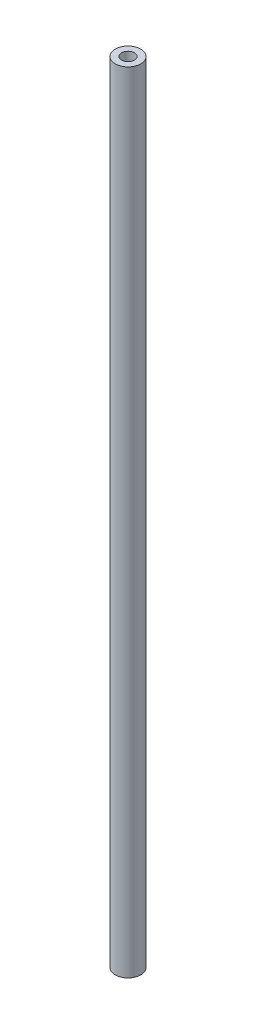
ISO-10303-21;
HEADER;
FILE_DESCRIPTION(('STEP AP214'),'2;1');
FILE_NAME('part.step','',(''),(''),'','','');
FILE_SCHEMA(('AUTOMOTIVE_DESIGN { 1 0 10303 214 1 1 1 1 }'));
ENDSEC;
DATA;
#1=APPLICATION_CONTEXT('core data for automotive mechanical design processes');
#2=APPLICATION_PROTOCOL_DEFINITION('international standard','automotive_design',2000,#1);
#3=PRODUCT_CONTEXT('',#1,'mechanical');
#4=PRODUCT('Part','Part','',(#3));
#5=PRODUCT_RELATED_PRODUCT_CATEGORY('part','',(#4));
#6=PRODUCT_DEFINITION_FORMATION('','',#4);
#7=PRODUCT_DEFINITION_CONTEXT('part definition',#1,'design');
#8=PRODUCT_DEFINITION('design','',#6,#7);
#9=PRODUCT_DEFINITION_SHAPE('','',#8);
#10=(LENGTH_UNIT() NAMED_UNIT(*) SI_UNIT(.MILLI.,.METRE.));
#11=(NAMED_UNIT(*) PLANE_ANGLE_UNIT() SI_UNIT($,.RADIAN.));
#12=(NAMED_UNIT(*) SI_UNIT($,.STERADIAN.) SOLID_ANGLE_UNIT());
#13=UNCERTAINTY_MEASURE_WITH_UNIT(LENGTH_MEASURE(1.E-05),#10,'distance_accuracy_value','');
#14=(GEOMETRIC_REPRESENTATION_CONTEXT(3) GLOBAL_UNCERTAINTY_ASSIGNED_CONTEXT((#13)) GLOBAL_UNIT_ASSIGNED_CONTEXT((#10,
#11,#12)) REPRESENTATION_CONTEXT('',''));
#15=CARTESIAN_POINT('',(0.,0.,0.));
#16=DIRECTION('',(0.,0.,1.));
#17=DIRECTION('',(1.,0.,0.));
#18=AXIS2_PLACEMENT_3D('',#15,#16,#17);
#19=CARTESIAN_POINT('',(0.,391.414,0.));
#20=DIRECTION('',(0.,1.,0.));
#21=DIRECTION('',(0.,0.,1.));
#22=AXIS2_PLACEMENT_3D('',#19,#20,#21);
#23=PLANE('',#22);
#24=CARTESIAN_POINT('',(0.,391.414,0.));
#25=DIRECTION('',(0.,1.,0.));
#26=DIRECTION('',(0.,0.,1.));
#27=AXIS2_PLACEMENT_3D('',#24,#25,#26);
#28=CIRCLE('',#27,6.35);
#29=CARTESIAN_POINT('',(0.,391.414,6.35));
#30=VERTEX_POINT('',#29);
#31=EDGE_CURVE('E10',#30,#30,#28,.T.);
#32=ORIENTED_EDGE('',*,*,#31,.T.);
#33=EDGE_LOOP('',(#32));
#34=FACE_BOUND('',#33,.T.);
#35=CARTESIAN_POINT('',(0.,391.414,0.));
#36=DIRECTION('',(0.,1.,0.));
#37=DIRECTION('',(0.,0.,1.));
#38=AXIS2_PLACEMENT_3D('',#35,#36,#37);
#39=CIRCLE('',#38,3.175);
#40=CARTESIAN_POINT('',(0.,391.414,3.175));
#41=VERTEX_POINT('',#40);
#42=EDGE_CURVE('E42',#41,#41,#39,.T.);
#43=ORIENTED_EDGE('',*,*,#42,.F.);
#44=EDGE_LOOP('',(#43));
#45=FACE_BOUND('',#44,.T.);
#46=ADVANCED_FACE('F31',(#34,#45),#23,.T.);
#47=CARTESIAN_POINT('',(0.,0.,0.));
#48=DIRECTION('',(0.,1.,0.));
#49=DIRECTION('',(0.,0.,1.));
#50=AXIS2_PLACEMENT_3D('',#47,#48,#49);
#51=PLANE('',#50);
#52=CARTESIAN_POINT('',(0.,0.,0.));
#53=DIRECTION('',(0.,1.,0.));
#54=DIRECTION('',(0.,0.,1.));
#55=AXIS2_PLACEMENT_3D('',#52,#53,#54);
#56=CIRCLE('',#55,6.35);
#57=CARTESIAN_POINT('',(0.,0.,6.35));
#58=VERTEX_POINT('',#57);
#59=EDGE_CURVE('E35',#58,#58,#56,.T.);
#60=ORIENTED_EDGE('',*,*,#59,.F.);
#61=EDGE_LOOP('',(#60));
#62=FACE_BOUND('',#61,.T.);
#63=CARTESIAN_POINT('',(0.,0.,0.));
#64=DIRECTION('',(0.,1.,0.));
#65=DIRECTION('',(0.,0.,1.));
#66=AXIS2_PLACEMENT_3D('',#63,#64,#65);
#67=CIRCLE('',#66,3.175);
#68=CARTESIAN_POINT('',(0.,0.,3.175));
#69=VERTEX_POINT('',#68);
#70=EDGE_CURVE('E44',#69,#69,#67,.T.);
#71=ORIENTED_EDGE('',*,*,#70,.T.);
#72=EDGE_LOOP('',(#71));
#73=FACE_BOUND('',#72,.T.);
#74=ADVANCED_FACE('F54',(#62,#73),#51,.F.);
#75=CARTESIAN_POINT('',(0.,391.414,0.));
#76=DIRECTION('',(0.,-1.,0.));
#77=DIRECTION('',(0.,0.,-1.));
#78=AXIS2_PLACEMENT_3D('',#75,#76,#77);
#79=CYLINDRICAL_SURFACE('',#78,6.35);
#80=ORIENTED_EDGE('',*,*,#31,.F.);
#81=EDGE_LOOP('',(#80));
#82=FACE_BOUND('',#81,.T.);
#83=ORIENTED_EDGE('',*,*,#59,.T.);
#84=EDGE_LOOP('',(#83));
#85=FACE_BOUND('',#84,.T.);
#86=ADVANCED_FACE('F33',(#82,#85),#79,.T.);
#87=CARTESIAN_POINT('',(0.,391.414,0.));
#88=DIRECTION('',(0.,-1.,0.));
#89=DIRECTION('',(0.,0.,-1.));
#90=AXIS2_PLACEMENT_3D('',#87,#88,#89);
#91=CYLINDRICAL_SURFACE('',#90,3.175);
#92=ORIENTED_EDGE('',*,*,#42,.T.);
#93=EDGE_LOOP('',(#92));
#94=FACE_BOUND('',#93,.T.);
#95=ORIENTED_EDGE('',*,*,#70,.F.);
#96=EDGE_LOOP('',(#95));
#97=FACE_BOUND('',#96,.T.);
#98=ADVANCED_FACE('F50',(#94,#97),#91,.F.);
#99=CLOSED_SHELL('',(#46,#74,#86,#98));
#100=MANIFOLD_SOLID_BREP('B2',#99);
#101=ADVANCED_BREP_SHAPE_REPRESENTATION('',(#18,#100),#14);
#102=SHAPE_DEFINITION_REPRESENTATION(#9,#101);
ENDSEC;
END-ISO-10303-21;
